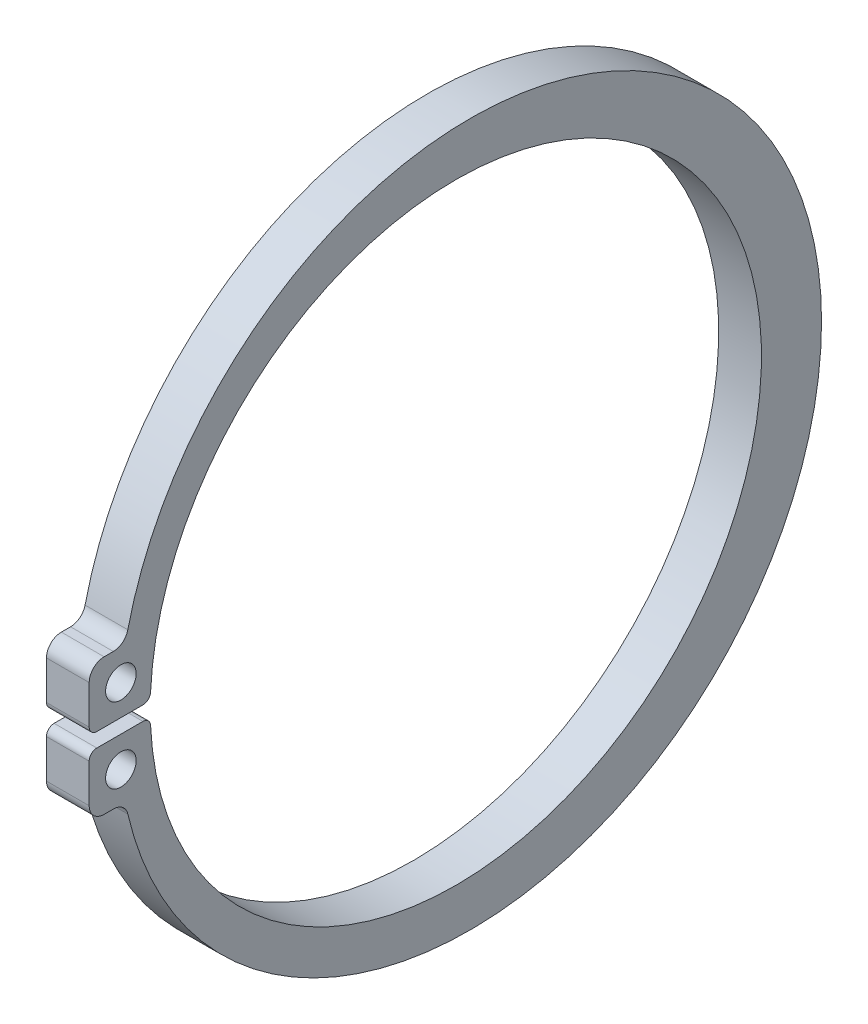
ISO-10303-21;
HEADER;
FILE_DESCRIPTION(('STEP AP214'),'2;1');
FILE_NAME('part.step','',(''),(''),'','','');
FILE_SCHEMA(('AUTOMOTIVE_DESIGN { 1 0 10303 214 1 1 1 1 }'));
ENDSEC;
DATA;
#1=APPLICATION_CONTEXT('core data for automotive mechanical design processes');
#2=APPLICATION_PROTOCOL_DEFINITION('international standard','automotive_design',2000,#1);
#3=PRODUCT_CONTEXT('',#1,'mechanical');
#4=PRODUCT('Part','Part','',(#3));
#5=PRODUCT_RELATED_PRODUCT_CATEGORY('part','',(#4));
#6=PRODUCT_DEFINITION_FORMATION('','',#4);
#7=PRODUCT_DEFINITION_CONTEXT('part definition',#1,'design');
#8=PRODUCT_DEFINITION('design','',#6,#7);
#9=PRODUCT_DEFINITION_SHAPE('','',#8);
#10=(LENGTH_UNIT() NAMED_UNIT(*) SI_UNIT(.MILLI.,.METRE.));
#11=(NAMED_UNIT(*) PLANE_ANGLE_UNIT() SI_UNIT($,.RADIAN.));
#12=(NAMED_UNIT(*) SI_UNIT($,.STERADIAN.) SOLID_ANGLE_UNIT());
#13=UNCERTAINTY_MEASURE_WITH_UNIT(LENGTH_MEASURE(1.E-05),#10,'distance_accuracy_value','');
#14=(GEOMETRIC_REPRESENTATION_CONTEXT(3) GLOBAL_UNCERTAINTY_ASSIGNED_CONTEXT((#13)) GLOBAL_UNIT_ASSIGNED_CONTEXT((#10,
#11,#12)) REPRESENTATION_CONTEXT('',''));
#15=CARTESIAN_POINT('',(0.,0.,0.));
#16=DIRECTION('',(0.,0.,1.));
#17=DIRECTION('',(1.,0.,0.));
#18=AXIS2_PLACEMENT_3D('',#15,#16,#17);
#19=CARTESIAN_POINT('',(-33.,8.56791666666667,-1.25745180226376));
#20=DIRECTION('',(-1.,0.,0.));
#21=DIRECTION('',(0.,0.,1.));
#22=AXIS2_PLACEMENT_3D('',#19,#20,#21);
#23=CYLINDRICAL_SURFACE('',#22,0.178750000000002);
#24=CARTESIAN_POINT('',(-34.,8.56791666666667,-1.25745180226376));
#25=DIRECTION('',(-1.,0.,0.));
#26=DIRECTION('',(0.,0.,1.));
#27=AXIS2_PLACEMENT_3D('',#24,#25,#26);
#28=CIRCLE('',#27,0.178750000000002);
#29=CARTESIAN_POINT('',(-34.,8.5594918699187,-1.4360031542602));
#30=VERTEX_POINT('',#29);
#31=CARTESIAN_POINT('',(-34.,8.38916666666667,-1.25745180226376));
#32=VERTEX_POINT('',#31);
#33=EDGE_CURVE('E184',#30,#32,#28,.T.);
#34=ORIENTED_EDGE('',*,*,#33,.F.);
#35=DIRECTION('',(-1.,0.,0.));
#36=VECTOR('',#35,1.);
#37=CARTESIAN_POINT('',(-33.,8.5594918699187,-1.4360031542602));
#38=LINE('',#37,#36);
#39=CARTESIAN_POINT('',(-33.,8.5594918699187,-1.4360031542602));
#40=VERTEX_POINT('',#39);
#41=EDGE_CURVE('E11',#40,#30,#38,.T.);
#42=ORIENTED_EDGE('',*,*,#41,.F.);
#43=CARTESIAN_POINT('',(-33.,8.56791666666667,-1.25745180226376));
#44=DIRECTION('',(-1.,0.,0.));
#45=DIRECTION('',(0.,0.,1.));
#46=AXIS2_PLACEMENT_3D('',#43,#44,#45);
#47=CIRCLE('',#46,0.178750000000002);
#48=CARTESIAN_POINT('',(-33.,8.38916666666667,-1.25745180226376));
#49=VERTEX_POINT('',#48);
#50=EDGE_CURVE('E229',#40,#49,#47,.T.);
#51=ORIENTED_EDGE('',*,*,#50,.T.);
#52=DIRECTION('',(-1.,0.,0.));
#53=VECTOR('',#52,1.);
#54=CARTESIAN_POINT('',(-33.,8.38916666666667,-1.25745180226376));
#55=LINE('',#54,#53);
#56=EDGE_CURVE('E42',#49,#32,#55,.T.);
#57=ORIENTED_EDGE('',*,*,#56,.T.);
#58=EDGE_LOOP('',(#34,#42,#51,#57));
#59=FACE_BOUND('',#58,.T.);
#60=ADVANCED_FACE('F39',(#59),#23,.T.);
#61=CARTESIAN_POINT('',(-33.,8.2225,-8.57805723411767));
#62=DIRECTION('',(-1.,0.,0.));
#63=DIRECTION('',(0.,0.,1.));
#64=AXIS2_PLACEMENT_3D('',#61,#62,#63);
#65=CYLINDRICAL_SURFACE('',#64,7.15);
#66=CARTESIAN_POINT('',(-34.,8.2225,-8.57805723411767));
#67=DIRECTION('',(1.,0.,0.));
#68=DIRECTION('',(0.,0.,-1.));
#69=AXIS2_PLACEMENT_3D('',#66,#67,#68);
#70=CIRCLE('',#69,7.15);
#71=CARTESIAN_POINT('',(-34.,7.8855081300813,-1.4360031542602));
#72=VERTEX_POINT('',#71);
#73=EDGE_CURVE('E227',#72,#30,#70,.T.);
#74=ORIENTED_EDGE('',*,*,#73,.F.);
#75=DIRECTION('',(-1.,0.,0.));
#76=VECTOR('',#75,1.);
#77=CARTESIAN_POINT('',(-33.,7.8855081300813,-1.4360031542602));
#78=LINE('',#77,#76);
#79=CARTESIAN_POINT('',(-33.,7.8855081300813,-1.4360031542602));
#80=VERTEX_POINT('',#79);
#81=EDGE_CURVE('E48',#80,#72,#78,.T.);
#82=ORIENTED_EDGE('',*,*,#81,.F.);
#83=CARTESIAN_POINT('',(-33.,8.2225,-8.57805723411767));
#84=DIRECTION('',(1.,0.,0.));
#85=DIRECTION('',(0.,0.,-1.));
#86=AXIS2_PLACEMENT_3D('',#83,#84,#85);
#87=CIRCLE('',#86,7.15);
#88=EDGE_CURVE('E174',#80,#40,#87,.T.);
#89=ORIENTED_EDGE('',*,*,#88,.T.);
#90=ORIENTED_EDGE('',*,*,#41,.T.);
#91=EDGE_LOOP('',(#74,#82,#89,#90));
#92=FACE_BOUND('',#91,.T.);
#93=ADVANCED_FACE('F257',(#92),#65,.F.);
#94=CARTESIAN_POINT('',(-33.,7.87708333333333,-1.25745180226376));
#95=DIRECTION('',(-1.,0.,0.));
#96=DIRECTION('',(0.,0.,1.));
#97=AXIS2_PLACEMENT_3D('',#94,#95,#96);
#98=CYLINDRICAL_SURFACE('',#97,0.178750000000002);
#99=CARTESIAN_POINT('',(-34.,7.87708333333333,-1.25745180226376));
#100=DIRECTION('',(-1.,0.,0.));
#101=DIRECTION('',(0.,0.,1.));
#102=AXIS2_PLACEMENT_3D('',#99,#100,#101);
#103=CIRCLE('',#102,0.178750000000002);
#104=CARTESIAN_POINT('',(-34.,8.05583333333333,-1.25745180226376));
#105=VERTEX_POINT('',#104);
#106=EDGE_CURVE('E161',#105,#72,#103,.T.);
#107=ORIENTED_EDGE('',*,*,#106,.F.);
#108=DIRECTION('',(-1.,0.,0.));
#109=VECTOR('',#108,1.);
#110=CARTESIAN_POINT('',(-33.,8.05583333333333,-1.25745180226376));
#111=LINE('',#110,#109);
#112=CARTESIAN_POINT('',(-33.,8.05583333333333,-1.25745180226376));
#113=VERTEX_POINT('',#112);
#114=EDGE_CURVE('E156',#113,#105,#111,.T.);
#115=ORIENTED_EDGE('',*,*,#114,.F.);
#116=CARTESIAN_POINT('',(-33.,7.87708333333333,-1.25745180226376));
#117=DIRECTION('',(-1.,0.,0.));
#118=DIRECTION('',(0.,0.,1.));
#119=AXIS2_PLACEMENT_3D('',#116,#117,#118);
#120=CIRCLE('',#119,0.178750000000002);
#121=EDGE_CURVE('E159',#113,#80,#120,.T.);
#122=ORIENTED_EDGE('',*,*,#121,.T.);
#123=ORIENTED_EDGE('',*,*,#81,.T.);
#124=EDGE_LOOP('',(#107,#115,#122,#123));
#125=FACE_BOUND('',#124,.T.);
#126=ADVANCED_FACE('F158',(#125),#98,.T.);
#127=CARTESIAN_POINT('',(-33.,8.05583333333333,-0.178749999999978));
#128=DIRECTION('',(0.,1.,0.));
#129=DIRECTION('',(0.,0.,1.));
#130=AXIS2_PLACEMENT_3D('',#127,#128,#129);
#131=PLANE('',#130);
#132=DIRECTION('',(0.,0.,-1.));
#133=VECTOR('',#132,1.);
#134=CARTESIAN_POINT('',(-34.,8.05583333333333,-0.178749999999979));
#135=LINE('',#134,#133);
#136=CARTESIAN_POINT('',(-34.,8.05583333333333,-0.178749999999979));
#137=VERTEX_POINT('',#136);
#138=EDGE_CURVE('E224',#137,#105,#135,.T.);
#139=ORIENTED_EDGE('',*,*,#138,.F.);
#140=DIRECTION('',(-1.,0.,0.));
#141=VECTOR('',#140,1.);
#142=CARTESIAN_POINT('',(-33.,8.05583333333333,-0.178749999999978));
#143=LINE('',#142,#141);
#144=CARTESIAN_POINT('',(-33.,8.05583333333333,-0.178749999999978));
#145=VERTEX_POINT('',#144);
#146=EDGE_CURVE('E166',#145,#137,#143,.T.);
#147=ORIENTED_EDGE('',*,*,#146,.F.);
#148=DIRECTION('',(0.,0.,-1.));
#149=VECTOR('',#148,1.);
#150=CARTESIAN_POINT('',(-33.,8.05583333333333,-0.178749999999978));
#151=LINE('',#150,#149);
#152=EDGE_CURVE('E172',#145,#113,#151,.T.);
#153=ORIENTED_EDGE('',*,*,#152,.T.);
#154=ORIENTED_EDGE('',*,*,#114,.T.);
#155=EDGE_LOOP('',(#139,#147,#153,#154));
#156=FACE_BOUND('',#155,.T.);
#157=ADVANCED_FACE('F176',(#156),#131,.T.);
#158=CARTESIAN_POINT('',(-33.,7.87708333333333,-0.178749999999978));
#159=DIRECTION('',(-1.,0.,0.));
#160=DIRECTION('',(0.,0.,1.));
#161=AXIS2_PLACEMENT_3D('',#158,#159,#160);
#162=CYLINDRICAL_SURFACE('',#161,0.17875);
#163=CARTESIAN_POINT('',(-34.,7.87708333333333,-0.178749999999979));
#164=DIRECTION('',(-1.,0.,0.));
#165=DIRECTION('',(0.,0.,1.));
#166=AXIS2_PLACEMENT_3D('',#163,#164,#165);
#167=CIRCLE('',#166,0.17875);
#168=CARTESIAN_POINT('',(-34.,7.87708333333333,0.));
#169=VERTEX_POINT('',#168);
#170=EDGE_CURVE('E221',#169,#137,#167,.T.);
#171=ORIENTED_EDGE('',*,*,#170,.F.);
#172=DIRECTION('',(-1.,0.,0.));
#173=VECTOR('',#172,1.);
#174=CARTESIAN_POINT('',(-33.,7.87708333333333,0.));
#175=LINE('',#174,#173);
#176=CARTESIAN_POINT('',(-33.,7.87708333333333,0.));
#177=VERTEX_POINT('',#176);
#178=EDGE_CURVE('E233',#177,#169,#175,.T.);
#179=ORIENTED_EDGE('',*,*,#178,.F.);
#180=CARTESIAN_POINT('',(-33.,7.87708333333333,-0.178749999999978));
#181=DIRECTION('',(-1.,0.,0.));
#182=DIRECTION('',(0.,0.,1.));
#183=AXIS2_PLACEMENT_3D('',#180,#181,#182);
#184=CIRCLE('',#183,0.17875);
#185=EDGE_CURVE('E177',#177,#145,#184,.T.);
#186=ORIENTED_EDGE('',*,*,#185,.T.);
#187=ORIENTED_EDGE('',*,*,#146,.T.);
#188=EDGE_LOOP('',(#171,#179,#186,#187));
#189=FACE_BOUND('',#188,.T.);
#190=ADVANCED_FACE('F270',(#189),#162,.T.);
#191=CARTESIAN_POINT('',(-33.,6.97461382113821,0.));
#192=DIRECTION('',(0.,0.,1.));
#193=DIRECTION('',(1.,0.,0.));
#194=AXIS2_PLACEMENT_3D('',#191,#192,#193);
#195=PLANE('',#194);
#196=DIRECTION('',(0.,1.,0.));
#197=VECTOR('',#196,1.);
#198=CARTESIAN_POINT('',(-34.,6.97461382113821,0.));
#199=LINE('',#198,#197);
#200=CARTESIAN_POINT('',(-34.,6.97461382113821,0.));
#201=VERTEX_POINT('',#200);
#202=EDGE_CURVE('E218',#201,#169,#199,.T.);
#203=ORIENTED_EDGE('',*,*,#202,.F.);
#204=DIRECTION('',(-1.,0.,0.));
#205=VECTOR('',#204,1.);
#206=CARTESIAN_POINT('',(-33.,6.97461382113821,0.));
#207=LINE('',#206,#205);
#208=CARTESIAN_POINT('',(-33.,6.97461382113821,0.));
#209=VERTEX_POINT('',#208);
#210=EDGE_CURVE('E235',#209,#201,#207,.T.);
#211=ORIENTED_EDGE('',*,*,#210,.F.);
#212=DIRECTION('',(0.,1.,0.));
#213=VECTOR('',#212,1.);
#214=CARTESIAN_POINT('',(-33.,6.97461382113821,0.));
#215=LINE('',#214,#213);
#216=EDGE_CURVE('E179',#209,#177,#215,.T.);
#217=ORIENTED_EDGE('',*,*,#216,.T.);
#218=ORIENTED_EDGE('',*,*,#178,.T.);
#219=EDGE_LOOP('',(#203,#211,#217,#218));
#220=FACE_BOUND('',#219,.T.);
#221=ADVANCED_FACE('F273',(#220),#195,.T.);
#222=CARTESIAN_POINT('',(-33.,6.97461382113821,-0.348780487804858));
#223=DIRECTION('',(-1.,0.,0.));
#224=DIRECTION('',(0.,0.,1.));
#225=AXIS2_PLACEMENT_3D('',#222,#223,#224);
#226=CYLINDRICAL_SURFACE('',#225,0.34878048780488);
#227=CARTESIAN_POINT('',(-34.,6.97461382113821,-0.348780487804859));
#228=DIRECTION('',(-1.,0.,0.));
#229=DIRECTION('',(0.,0.,1.));
#230=AXIS2_PLACEMENT_3D('',#227,#228,#229);
#231=CIRCLE('',#230,0.34878048780488);
#232=CARTESIAN_POINT('',(-34.,6.62583333333333,-0.348780487804859));
#233=VERTEX_POINT('',#232);
#234=EDGE_CURVE('E215',#233,#201,#231,.T.);
#235=ORIENTED_EDGE('',*,*,#234,.F.);
#236=DIRECTION('',(-1.,0.,0.));
#237=VECTOR('',#236,1.);
#238=CARTESIAN_POINT('',(-33.,6.62583333333333,-0.348780487804858));
#239=LINE('',#238,#237);
#240=CARTESIAN_POINT('',(-33.,6.62583333333333,-0.348780487804858));
#241=VERTEX_POINT('',#240);
#242=EDGE_CURVE('E237',#241,#233,#239,.T.);
#243=ORIENTED_EDGE('',*,*,#242,.F.);
#244=CARTESIAN_POINT('',(-33.,6.97461382113821,-0.348780487804858));
#245=DIRECTION('',(-1.,0.,0.));
#246=DIRECTION('',(0.,0.,1.));
#247=AXIS2_PLACEMENT_3D('',#244,#245,#246);
#248=CIRCLE('',#247,0.34878048780488);
#249=EDGE_CURVE('E375',#241,#209,#248,.T.);
#250=ORIENTED_EDGE('',*,*,#249,.T.);
#251=ORIENTED_EDGE('',*,*,#210,.T.);
#252=EDGE_LOOP('',(#235,#243,#250,#251));
#253=FACE_BOUND('',#252,.T.);
#254=ADVANCED_FACE('F277',(#253),#226,.T.);
#255=CARTESIAN_POINT('',(-33.,6.62583333333333,-0.563811003901858));
#256=DIRECTION('',(0.,-1.,0.));
#257=DIRECTION('',(0.,0.,-1.));
#258=AXIS2_PLACEMENT_3D('',#255,#256,#257);
#259=PLANE('',#258);
#260=DIRECTION('',(0.,0.,1.));
#261=VECTOR('',#260,1.);
#262=CARTESIAN_POINT('',(-34.,6.62583333333333,-0.563811003901859));
#263=LINE('',#262,#261);
#264=CARTESIAN_POINT('',(-34.,6.62583333333333,-0.563811003901859));
#265=VERTEX_POINT('',#264);
#266=EDGE_CURVE('E212',#265,#233,#263,.T.);
#267=ORIENTED_EDGE('',*,*,#266,.F.);
#268=DIRECTION('',(-1.,0.,0.));
#269=VECTOR('',#268,1.);
#270=CARTESIAN_POINT('',(-33.,6.62583333333333,-0.563811003901858));
#271=LINE('',#270,#269);
#272=CARTESIAN_POINT('',(-33.,6.62583333333333,-0.563811003901858));
#273=VERTEX_POINT('',#272);
#274=EDGE_CURVE('E239',#273,#265,#271,.T.);
#275=ORIENTED_EDGE('',*,*,#274,.F.);
#276=DIRECTION('',(0.,0.,1.));
#277=VECTOR('',#276,1.);
#278=CARTESIAN_POINT('',(-33.,6.62583333333333,-0.563811003901858));
#279=LINE('',#278,#277);
#280=EDGE_CURVE('E372',#273,#241,#279,.T.);
#281=ORIENTED_EDGE('',*,*,#280,.T.);
#282=ORIENTED_EDGE('',*,*,#242,.T.);
#283=EDGE_LOOP('',(#267,#275,#281,#282));
#284=FACE_BOUND('',#283,.T.);
#285=ADVANCED_FACE('F281',(#284),#259,.T.);
#286=CARTESIAN_POINT('',(-33.,6.27705284552846,-0.563811003901858));
#287=DIRECTION('',(-1.,0.,0.));
#288=DIRECTION('',(0.,0.,1.));
#289=AXIS2_PLACEMENT_3D('',#286,#287,#288);
#290=CYLINDRICAL_SURFACE('',#289,0.348780487804876);
#291=CARTESIAN_POINT('',(-34.,6.27705284552846,-0.563811003901859));
#292=DIRECTION('',(1.,0.,0.));
#293=DIRECTION('',(0.,0.,-1.));
#294=AXIS2_PLACEMENT_3D('',#291,#292,#293);
#295=CIRCLE('',#294,0.348780487804876);
#296=CARTESIAN_POINT('',(-34.,6.35621651407256,-0.903488707403352));
#297=VERTEX_POINT('',#296);
#298=EDGE_CURVE('E209',#297,#265,#295,.T.);
#299=ORIENTED_EDGE('',*,*,#298,.F.);
#300=DIRECTION('',(-1.,0.,0.));
#301=VECTOR('',#300,1.);
#302=CARTESIAN_POINT('',(-33.,6.35621651407256,-0.903488707403351));
#303=LINE('',#302,#301);
#304=CARTESIAN_POINT('',(-33.,6.35621651407256,-0.903488707403351));
#305=VERTEX_POINT('',#304);
#306=EDGE_CURVE('E241',#305,#297,#303,.T.);
#307=ORIENTED_EDGE('',*,*,#306,.F.);
#308=CARTESIAN_POINT('',(-33.,6.27705284552846,-0.563811003901858));
#309=DIRECTION('',(1.,0.,0.));
#310=DIRECTION('',(0.,0.,-1.));
#311=AXIS2_PLACEMENT_3D('',#308,#309,#310);
#312=CIRCLE('',#311,0.348780487804876);
#313=EDGE_CURVE('E369',#305,#273,#312,.T.);
#314=ORIENTED_EDGE('',*,*,#313,.T.);
#315=ORIENTED_EDGE('',*,*,#274,.T.);
#316=EDGE_LOOP('',(#299,#307,#314,#315));
#317=FACE_BOUND('',#316,.T.);
#318=ADVANCED_FACE('F285',(#317),#290,.F.);
#319=CARTESIAN_POINT('',(-33.,8.2225,-8.911390567451));
#320=DIRECTION('',(-1.,0.,0.));
#321=DIRECTION('',(0.,0.,1.));
#322=AXIS2_PLACEMENT_3D('',#319,#320,#321);
#323=CYLINDRICAL_SURFACE('',#322,8.2225);
#324=CARTESIAN_POINT('',(-34.,8.2225,-8.911390567451));
#325=DIRECTION('',(-1.,0.,0.));
#326=DIRECTION('',(0.,0.,1.));
#327=AXIS2_PLACEMENT_3D('',#324,#325,#326);
#328=CIRCLE('',#327,8.2225);
#329=CARTESIAN_POINT('',(-34.,10.0887834859274,-0.903488707403351));
#330=VERTEX_POINT('',#329);
#331=EDGE_CURVE('E206',#330,#297,#328,.T.);
#332=ORIENTED_EDGE('',*,*,#331,.F.);
#333=DIRECTION('',(-1.,0.,0.));
#334=VECTOR('',#333,1.);
#335=CARTESIAN_POINT('',(-33.,10.0887834859274,-0.90348870740335));
#336=LINE('',#335,#334);
#337=CARTESIAN_POINT('',(-33.,10.0887834859274,-0.90348870740335));
#338=VERTEX_POINT('',#337);
#339=EDGE_CURVE('E243',#338,#330,#336,.T.);
#340=ORIENTED_EDGE('',*,*,#339,.F.);
#341=CARTESIAN_POINT('',(-33.,8.2225,-8.911390567451));
#342=DIRECTION('',(-1.,0.,0.));
#343=DIRECTION('',(0.,0.,1.));
#344=AXIS2_PLACEMENT_3D('',#341,#342,#343);
#345=CIRCLE('',#344,8.2225);
#346=EDGE_CURVE('E366',#338,#305,#345,.T.);
#347=ORIENTED_EDGE('',*,*,#346,.T.);
#348=ORIENTED_EDGE('',*,*,#306,.T.);
#349=EDGE_LOOP('',(#332,#340,#347,#348));
#350=FACE_BOUND('',#349,.T.);
#351=ADVANCED_FACE('F289',(#350),#323,.T.);
#352=CARTESIAN_POINT('',(-33.,10.1679471544715,-0.563811003901858));
#353=DIRECTION('',(-1.,0.,0.));
#354=DIRECTION('',(0.,0.,1.));
#355=AXIS2_PLACEMENT_3D('',#352,#353,#354);
#356=CYLINDRICAL_SURFACE('',#355,0.348780487804879);
#357=CARTESIAN_POINT('',(-34.,10.1679471544715,-0.563811003901859));
#358=DIRECTION('',(1.,0.,0.));
#359=DIRECTION('',(0.,0.,-1.));
#360=AXIS2_PLACEMENT_3D('',#357,#358,#359);
#361=CIRCLE('',#360,0.348780487804879);
#362=CARTESIAN_POINT('',(-34.,9.81916666666667,-0.563811003901859));
#363=VERTEX_POINT('',#362);
#364=EDGE_CURVE('E203',#363,#330,#361,.T.);
#365=ORIENTED_EDGE('',*,*,#364,.F.);
#366=DIRECTION('',(-1.,0.,0.));
#367=VECTOR('',#366,1.);
#368=CARTESIAN_POINT('',(-33.,9.81916666666667,-0.563811003901858));
#369=LINE('',#368,#367);
#370=CARTESIAN_POINT('',(-33.,9.81916666666667,-0.563811003901858));
#371=VERTEX_POINT('',#370);
#372=EDGE_CURVE('E245',#371,#363,#369,.T.);
#373=ORIENTED_EDGE('',*,*,#372,.F.);
#374=CARTESIAN_POINT('',(-33.,10.1679471544715,-0.563811003901858));
#375=DIRECTION('',(1.,0.,0.));
#376=DIRECTION('',(0.,0.,-1.));
#377=AXIS2_PLACEMENT_3D('',#374,#375,#376);
#378=CIRCLE('',#377,0.348780487804879);
#379=EDGE_CURVE('E363',#371,#338,#378,.T.);
#380=ORIENTED_EDGE('',*,*,#379,.T.);
#381=ORIENTED_EDGE('',*,*,#339,.T.);
#382=EDGE_LOOP('',(#365,#373,#380,#381));
#383=FACE_BOUND('',#382,.T.);
#384=ADVANCED_FACE('F293',(#383),#356,.F.);
#385=CARTESIAN_POINT('',(-33.,9.81916666666667,-0.348780487804858));
#386=DIRECTION('',(0.,1.,0.));
#387=DIRECTION('',(0.,0.,1.));
#388=AXIS2_PLACEMENT_3D('',#385,#386,#387);
#389=PLANE('',#388);
#390=DIRECTION('',(0.,0.,-1.));
#391=VECTOR('',#390,1.);
#392=CARTESIAN_POINT('',(-34.,9.81916666666667,-0.348780487804859));
#393=LINE('',#392,#391);
#394=CARTESIAN_POINT('',(-34.,9.81916666666667,-0.348780487804859));
#395=VERTEX_POINT('',#394);
#396=EDGE_CURVE('E200',#395,#363,#393,.T.);
#397=ORIENTED_EDGE('',*,*,#396,.F.);
#398=DIRECTION('',(-1.,0.,0.));
#399=VECTOR('',#398,1.);
#400=CARTESIAN_POINT('',(-33.,9.81916666666667,-0.348780487804858));
#401=LINE('',#400,#399);
#402=CARTESIAN_POINT('',(-33.,9.81916666666667,-0.348780487804858));
#403=VERTEX_POINT('',#402);
#404=EDGE_CURVE('E247',#403,#395,#401,.T.);
#405=ORIENTED_EDGE('',*,*,#404,.F.);
#406=DIRECTION('',(0.,0.,-1.));
#407=VECTOR('',#406,1.);
#408=CARTESIAN_POINT('',(-33.,9.81916666666667,-0.348780487804858));
#409=LINE('',#408,#407);
#410=EDGE_CURVE('E360',#403,#371,#409,.T.);
#411=ORIENTED_EDGE('',*,*,#410,.T.);
#412=ORIENTED_EDGE('',*,*,#372,.T.);
#413=EDGE_LOOP('',(#397,#405,#411,#412));
#414=FACE_BOUND('',#413,.T.);
#415=ADVANCED_FACE('F297',(#414),#389,.T.);
#416=CARTESIAN_POINT('',(-33.,9.47038617886179,-0.348780487804858));
#417=DIRECTION('',(-1.,0.,0.));
#418=DIRECTION('',(0.,0.,1.));
#419=AXIS2_PLACEMENT_3D('',#416,#417,#418);
#420=CYLINDRICAL_SURFACE('',#419,0.348780487804878);
#421=CARTESIAN_POINT('',(-34.,9.47038617886179,-0.348780487804859));
#422=DIRECTION('',(-1.,0.,0.));
#423=DIRECTION('',(0.,0.,1.));
#424=AXIS2_PLACEMENT_3D('',#421,#422,#423);
#425=CIRCLE('',#424,0.348780487804878);
#426=CARTESIAN_POINT('',(-34.,9.47038617886179,0.));
#427=VERTEX_POINT('',#426);
#428=EDGE_CURVE('E197',#427,#395,#425,.T.);
#429=ORIENTED_EDGE('',*,*,#428,.F.);
#430=DIRECTION('',(-1.,0.,0.));
#431=VECTOR('',#430,1.);
#432=CARTESIAN_POINT('',(-33.,9.47038617886179,0.));
#433=LINE('',#432,#431);
#434=CARTESIAN_POINT('',(-33.,9.47038617886179,0.));
#435=VERTEX_POINT('',#434);
#436=EDGE_CURVE('E249',#435,#427,#433,.T.);
#437=ORIENTED_EDGE('',*,*,#436,.F.);
#438=CARTESIAN_POINT('',(-33.,9.47038617886179,-0.348780487804858));
#439=DIRECTION('',(-1.,0.,0.));
#440=DIRECTION('',(0.,0.,1.));
#441=AXIS2_PLACEMENT_3D('',#438,#439,#440);
#442=CIRCLE('',#441,0.348780487804878);
#443=EDGE_CURVE('E357',#435,#403,#442,.T.);
#444=ORIENTED_EDGE('',*,*,#443,.T.);
#445=ORIENTED_EDGE('',*,*,#404,.T.);
#446=EDGE_LOOP('',(#429,#437,#444,#445));
#447=FACE_BOUND('',#446,.T.);
#448=ADVANCED_FACE('F301',(#447),#420,.T.);
#449=CARTESIAN_POINT('',(-33.,8.56791666666667,0.));
#450=DIRECTION('',(0.,0.,1.));
#451=DIRECTION('',(1.,0.,0.));
#452=AXIS2_PLACEMENT_3D('',#449,#450,#451);
#453=PLANE('',#452);
#454=DIRECTION('',(0.,1.,0.));
#455=VECTOR('',#454,1.);
#456=CARTESIAN_POINT('',(-34.,8.56791666666667,0.));
#457=LINE('',#456,#455);
#458=CARTESIAN_POINT('',(-34.,8.56791666666667,0.));
#459=VERTEX_POINT('',#458);
#460=EDGE_CURVE('E194',#459,#427,#457,.T.);
#461=ORIENTED_EDGE('',*,*,#460,.F.);
#462=DIRECTION('',(-1.,0.,0.));
#463=VECTOR('',#462,1.);
#464=CARTESIAN_POINT('',(-33.,8.56791666666667,0.));
#465=LINE('',#464,#463);
#466=CARTESIAN_POINT('',(-33.,8.56791666666667,0.));
#467=VERTEX_POINT('',#466);
#468=EDGE_CURVE('E251',#467,#459,#465,.T.);
#469=ORIENTED_EDGE('',*,*,#468,.F.);
#470=DIRECTION('',(0.,1.,0.));
#471=VECTOR('',#470,1.);
#472=CARTESIAN_POINT('',(-33.,8.56791666666667,0.));
#473=LINE('',#472,#471);
#474=EDGE_CURVE('E354',#467,#435,#473,.T.);
#475=ORIENTED_EDGE('',*,*,#474,.T.);
#476=ORIENTED_EDGE('',*,*,#436,.T.);
#477=EDGE_LOOP('',(#461,#469,#475,#476));
#478=FACE_BOUND('',#477,.T.);
#479=ADVANCED_FACE('F305',(#478),#453,.T.);
#480=CARTESIAN_POINT('',(-33.,8.56791666666667,-0.178749999999978));
#481=DIRECTION('',(-1.,0.,0.));
#482=DIRECTION('',(0.,0.,1.));
#483=AXIS2_PLACEMENT_3D('',#480,#481,#482);
#484=CYLINDRICAL_SURFACE('',#483,0.17875);
#485=CARTESIAN_POINT('',(-34.,8.56791666666667,-0.178749999999979));
#486=DIRECTION('',(-1.,0.,0.));
#487=DIRECTION('',(0.,0.,1.));
#488=AXIS2_PLACEMENT_3D('',#485,#486,#487);
#489=CIRCLE('',#488,0.17875);
#490=CARTESIAN_POINT('',(-34.,8.38916666666667,-0.178749999999979));
#491=VERTEX_POINT('',#490);
#492=EDGE_CURVE('E191',#491,#459,#489,.T.);
#493=ORIENTED_EDGE('',*,*,#492,.F.);
#494=DIRECTION('',(-1.,0.,0.));
#495=VECTOR('',#494,1.);
#496=CARTESIAN_POINT('',(-33.,8.38916666666667,-0.178749999999978));
#497=LINE('',#496,#495);
#498=CARTESIAN_POINT('',(-33.,8.38916666666667,-0.178749999999978));
#499=VERTEX_POINT('',#498);
#500=EDGE_CURVE('E252',#499,#491,#497,.T.);
#501=ORIENTED_EDGE('',*,*,#500,.F.);
#502=CARTESIAN_POINT('',(-33.,8.56791666666667,-0.178749999999978));
#503=DIRECTION('',(-1.,0.,0.));
#504=DIRECTION('',(0.,0.,1.));
#505=AXIS2_PLACEMENT_3D('',#502,#503,#504);
#506=CIRCLE('',#505,0.17875);
#507=EDGE_CURVE('E351',#499,#467,#506,.T.);
#508=ORIENTED_EDGE('',*,*,#507,.T.);
#509=ORIENTED_EDGE('',*,*,#468,.T.);
#510=EDGE_LOOP('',(#493,#501,#508,#509));
#511=FACE_BOUND('',#510,.T.);
#512=ADVANCED_FACE('F309',(#511),#484,.T.);
#513=CARTESIAN_POINT('',(-33.,8.38916666666667,-1.25745180226376));
#514=DIRECTION('',(0.,-1.,0.));
#515=DIRECTION('',(0.,0.,-1.));
#516=AXIS2_PLACEMENT_3D('',#513,#514,#515);
#517=PLANE('',#516);
#518=DIRECTION('',(0.,0.,1.));
#519=VECTOR('',#518,1.);
#520=CARTESIAN_POINT('',(-34.,8.38916666666667,-1.25745180226376));
#521=LINE('',#520,#519);
#522=EDGE_CURVE('E187',#32,#491,#521,.T.);
#523=ORIENTED_EDGE('',*,*,#522,.F.);
#524=ORIENTED_EDGE('',*,*,#56,.F.);
#525=DIRECTION('',(0.,0.,1.));
#526=VECTOR('',#525,1.);
#527=CARTESIAN_POINT('',(-33.,8.38916666666667,-1.25745180226376));
#528=LINE('',#527,#526);
#529=EDGE_CURVE('E349',#49,#499,#528,.T.);
#530=ORIENTED_EDGE('',*,*,#529,.T.);
#531=ORIENTED_EDGE('',*,*,#500,.T.);
#532=EDGE_LOOP('',(#523,#524,#530,#531));
#533=FACE_BOUND('',#532,.T.);
#534=ADVANCED_FACE('F254',(#533),#517,.T.);
#535=CARTESIAN_POINT('',(-33.,8.56791666666667,-1.25745180226376));
#536=DIRECTION('',(-1.,0.,0.));
#537=DIRECTION('',(0.,0.,1.));
#538=AXIS2_PLACEMENT_3D('',#535,#536,#537);
#539=PLANE('',#538);
#540=CARTESIAN_POINT('',(-33.,7.34083333333333,-0.741312313262498));
#541=DIRECTION('',(-1.,0.,0.));
#542=DIRECTION('',(0.,0.,-1.));
#543=AXIS2_PLACEMENT_3D('',#540,#541,#542);
#544=CIRCLE('',#543,0.3575);
#545=CARTESIAN_POINT('',(-33.,7.34083333333333,-1.0988123132625));
#546=VERTEX_POINT('',#545);
#547=EDGE_CURVE('E336',#546,#546,#544,.T.);
#548=ORIENTED_EDGE('',*,*,#547,.T.);
#549=EDGE_LOOP('',(#548));
#550=FACE_BOUND('',#549,.T.);
#551=CARTESIAN_POINT('',(-33.,9.10416666666667,-0.741312313262498));
#552=DIRECTION('',(-1.,0.,0.));
#553=DIRECTION('',(0.,0.,-1.));
#554=AXIS2_PLACEMENT_3D('',#551,#552,#553);
#555=CIRCLE('',#554,0.3575);
#556=CARTESIAN_POINT('',(-33.,9.10416666666667,-1.0988123132625));
#557=VERTEX_POINT('',#556);
#558=EDGE_CURVE('E188',#557,#557,#555,.T.);
#559=ORIENTED_EDGE('',*,*,#558,.T.);
#560=EDGE_LOOP('',(#559));
#561=FACE_BOUND('',#560,.T.);
#562=ORIENTED_EDGE('',*,*,#50,.F.);
#563=ORIENTED_EDGE('',*,*,#88,.F.);
#564=ORIENTED_EDGE('',*,*,#121,.F.);
#565=ORIENTED_EDGE('',*,*,#152,.F.);
#566=ORIENTED_EDGE('',*,*,#185,.F.);
#567=ORIENTED_EDGE('',*,*,#216,.F.);
#568=ORIENTED_EDGE('',*,*,#249,.F.);
#569=ORIENTED_EDGE('',*,*,#280,.F.);
#570=ORIENTED_EDGE('',*,*,#313,.F.);
#571=ORIENTED_EDGE('',*,*,#346,.F.);
#572=ORIENTED_EDGE('',*,*,#379,.F.);
#573=ORIENTED_EDGE('',*,*,#410,.F.);
#574=ORIENTED_EDGE('',*,*,#443,.F.);
#575=ORIENTED_EDGE('',*,*,#474,.F.);
#576=ORIENTED_EDGE('',*,*,#507,.F.);
#577=ORIENTED_EDGE('',*,*,#529,.F.);
#578=EDGE_LOOP('',(#562,#563,#564,#565,#566,#567,#568,#569,#570,#571,#572,#573,#574,#575,#576,#577));
#579=FACE_BOUND('',#578,.T.);
#580=ADVANCED_FACE('F170',(#550,#561,#579),#539,.F.);
#581=CARTESIAN_POINT('',(-34.,8.56791666666667,-1.25745180226376));
#582=DIRECTION('',(-1.,0.,0.));
#583=DIRECTION('',(0.,0.,1.));
#584=AXIS2_PLACEMENT_3D('',#581,#582,#583);
#585=PLANE('',#584);
#586=CARTESIAN_POINT('',(-34.,7.34083333333333,-0.741312313262499));
#587=DIRECTION('',(-1.,0.,0.));
#588=DIRECTION('',(0.,0.,-1.));
#589=AXIS2_PLACEMENT_3D('',#586,#587,#588);
#590=CIRCLE('',#589,0.3575);
#591=CARTESIAN_POINT('',(-34.,7.34083333333333,-1.0988123132625));
#592=VERTEX_POINT('',#591);
#593=EDGE_CURVE('E339',#592,#592,#590,.T.);
#594=ORIENTED_EDGE('',*,*,#593,.F.);
#595=EDGE_LOOP('',(#594));
#596=FACE_BOUND('',#595,.T.);
#597=CARTESIAN_POINT('',(-34.,9.10416666666667,-0.741312313262499));
#598=DIRECTION('',(-1.,0.,0.));
#599=DIRECTION('',(0.,0.,-1.));
#600=AXIS2_PLACEMENT_3D('',#597,#598,#599);
#601=CIRCLE('',#600,0.3575);
#602=CARTESIAN_POINT('',(-34.,9.10416666666667,-1.0988123132625));
#603=VERTEX_POINT('',#602);
#604=EDGE_CURVE('E341',#603,#603,#601,.T.);
#605=ORIENTED_EDGE('',*,*,#604,.F.);
#606=EDGE_LOOP('',(#605));
#607=FACE_BOUND('',#606,.T.);
#608=ORIENTED_EDGE('',*,*,#33,.T.);
#609=ORIENTED_EDGE('',*,*,#522,.T.);
#610=ORIENTED_EDGE('',*,*,#492,.T.);
#611=ORIENTED_EDGE('',*,*,#460,.T.);
#612=ORIENTED_EDGE('',*,*,#428,.T.);
#613=ORIENTED_EDGE('',*,*,#396,.T.);
#614=ORIENTED_EDGE('',*,*,#364,.T.);
#615=ORIENTED_EDGE('',*,*,#331,.T.);
#616=ORIENTED_EDGE('',*,*,#298,.T.);
#617=ORIENTED_EDGE('',*,*,#266,.T.);
#618=ORIENTED_EDGE('',*,*,#234,.T.);
#619=ORIENTED_EDGE('',*,*,#202,.T.);
#620=ORIENTED_EDGE('',*,*,#170,.T.);
#621=ORIENTED_EDGE('',*,*,#138,.T.);
#622=ORIENTED_EDGE('',*,*,#106,.T.);
#623=ORIENTED_EDGE('',*,*,#73,.T.);
#624=EDGE_LOOP('',(#608,#609,#610,#611,#612,#613,#614,#615,#616,#617,#618,#619,#620,#621,#622,#623));
#625=FACE_BOUND('',#624,.T.);
#626=ADVANCED_FACE('F256',(#596,#607,#625),#585,.T.);
#627=CARTESIAN_POINT('',(-33.,9.10416666666667,-0.741312313262498));
#628=DIRECTION('',(-1.,0.,0.));
#629=DIRECTION('',(0.,0.,1.));
#630=AXIS2_PLACEMENT_3D('',#627,#628,#629);
#631=CYLINDRICAL_SURFACE('',#630,0.3575);
#632=ORIENTED_EDGE('',*,*,#558,.F.);
#633=EDGE_LOOP('',(#632));
#634=FACE_BOUND('',#633,.T.);
#635=ORIENTED_EDGE('',*,*,#604,.T.);
#636=EDGE_LOOP('',(#635));
#637=FACE_BOUND('',#636,.T.);
#638=ADVANCED_FACE('F321',(#634,#637),#631,.F.);
#639=CARTESIAN_POINT('',(-33.,7.34083333333333,-0.741312313262498));
#640=DIRECTION('',(-1.,0.,0.));
#641=DIRECTION('',(0.,0.,1.));
#642=AXIS2_PLACEMENT_3D('',#639,#640,#641);
#643=CYLINDRICAL_SURFACE('',#642,0.3575);
#644=ORIENTED_EDGE('',*,*,#547,.F.);
#645=EDGE_LOOP('',(#644));
#646=FACE_BOUND('',#645,.T.);
#647=ORIENTED_EDGE('',*,*,#593,.T.);
#648=EDGE_LOOP('',(#647));
#649=FACE_BOUND('',#648,.T.);
#650=ADVANCED_FACE('F328',(#646,#649),#643,.F.);
#651=CLOSED_SHELL('',(#60,#93,#126,#157,#190,#221,#254,#285,#318,#351,#384,#415,#448,#479,#512,
#534,#580,#626,#638,#650));
#652=MANIFOLD_SOLID_BREP('B2',#651);
#653=ADVANCED_BREP_SHAPE_REPRESENTATION('',(#18,#652),#14);
#654=SHAPE_DEFINITION_REPRESENTATION(#9,#653);
ENDSEC;
END-ISO-10303-21;
